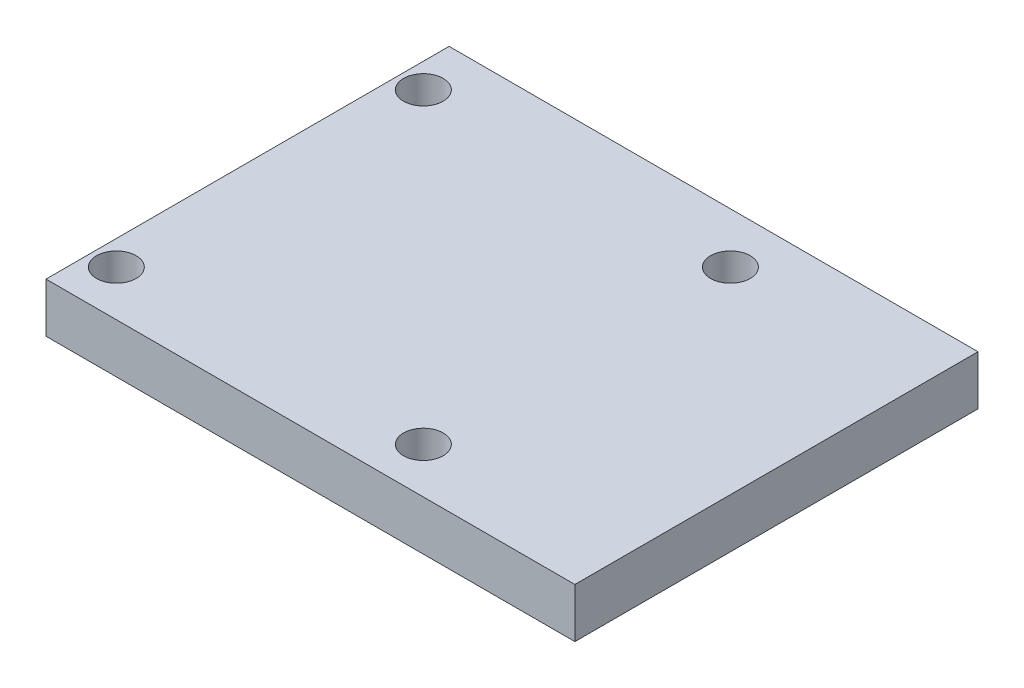
ISO-10303-21;
HEADER;
FILE_DESCRIPTION(('STEP AP214'),'2;1');
FILE_NAME('part.step','',(''),(''),'','','');
FILE_SCHEMA(('AUTOMOTIVE_DESIGN { 1 0 10303 214 1 1 1 1 }'));
ENDSEC;
DATA;
#1=APPLICATION_CONTEXT('core data for automotive mechanical design processes');
#2=APPLICATION_PROTOCOL_DEFINITION('international standard','automotive_design',2000,#1);
#3=PRODUCT_CONTEXT('',#1,'mechanical');
#4=PRODUCT('Part','Part','',(#3));
#5=PRODUCT_RELATED_PRODUCT_CATEGORY('part','',(#4));
#6=PRODUCT_DEFINITION_FORMATION('','',#4);
#7=PRODUCT_DEFINITION_CONTEXT('part definition',#1,'design');
#8=PRODUCT_DEFINITION('design','',#6,#7);
#9=PRODUCT_DEFINITION_SHAPE('','',#8);
#10=(LENGTH_UNIT() NAMED_UNIT(*) SI_UNIT(.MILLI.,.METRE.));
#11=(NAMED_UNIT(*) PLANE_ANGLE_UNIT() SI_UNIT($,.RADIAN.));
#12=(NAMED_UNIT(*) SI_UNIT($,.STERADIAN.) SOLID_ANGLE_UNIT());
#13=UNCERTAINTY_MEASURE_WITH_UNIT(LENGTH_MEASURE(1.E-05),#10,'distance_accuracy_value','');
#14=(GEOMETRIC_REPRESENTATION_CONTEXT(3) GLOBAL_UNCERTAINTY_ASSIGNED_CONTEXT((#13)) GLOBAL_UNIT_ASSIGNED_CONTEXT((#10,
#11,#12)) REPRESENTATION_CONTEXT('',''));
#15=CARTESIAN_POINT('',(0.,0.,0.));
#16=DIRECTION('',(0.,0.,1.));
#17=DIRECTION('',(1.,0.,0.));
#18=AXIS2_PLACEMENT_3D('',#15,#16,#17);
#19=CARTESIAN_POINT('',(26.7,5.,20.35));
#20=DIRECTION('',(-1.,0.,0.));
#21=DIRECTION('',(0.,0.,1.));
#22=AXIS2_PLACEMENT_3D('',#19,#20,#21);
#23=PLANE('',#22);
#24=DIRECTION('',(0.,0.,-1.));
#25=VECTOR('',#24,1.);
#26=CARTESIAN_POINT('',(26.7,0.,20.35));
#27=LINE('',#26,#25);
#28=CARTESIAN_POINT('',(26.7,0.,20.35));
#29=VERTEX_POINT('',#28);
#30=CARTESIAN_POINT('',(26.7,0.,-20.35));
#31=VERTEX_POINT('',#30);
#32=EDGE_CURVE('E106',#29,#31,#27,.T.);
#33=ORIENTED_EDGE('',*,*,#32,.T.);
#34=DIRECTION('',(0.,-1.,0.));
#35=VECTOR('',#34,1.);
#36=CARTESIAN_POINT('',(26.7,5.,-20.35));
#37=LINE('',#36,#35);
#38=CARTESIAN_POINT('',(26.7,5.,-20.35));
#39=VERTEX_POINT('',#38);
#40=EDGE_CURVE('E11',#39,#31,#37,.T.);
#41=ORIENTED_EDGE('',*,*,#40,.F.);
#42=DIRECTION('',(0.,0.,-1.));
#43=VECTOR('',#42,1.);
#44=CARTESIAN_POINT('',(26.7,5.,20.35));
#45=LINE('',#44,#43);
#46=CARTESIAN_POINT('',(26.7,5.,20.35));
#47=VERTEX_POINT('',#46);
#48=EDGE_CURVE('E94',#47,#39,#45,.T.);
#49=ORIENTED_EDGE('',*,*,#48,.F.);
#50=DIRECTION('',(0.,-1.,0.));
#51=VECTOR('',#50,1.);
#52=CARTESIAN_POINT('',(26.7,5.,20.35));
#53=LINE('',#52,#51);
#54=EDGE_CURVE('E102',#47,#29,#53,.T.);
#55=ORIENTED_EDGE('',*,*,#54,.T.);
#56=EDGE_LOOP('',(#33,#41,#49,#55));
#57=FACE_BOUND('',#56,.T.);
#58=ADVANCED_FACE('F43',(#57),#23,.F.);
#59=CARTESIAN_POINT('',(-26.7,5.,-20.35));
#60=DIRECTION('',(0.,0.,1.));
#61=DIRECTION('',(1.,0.,0.));
#62=AXIS2_PLACEMENT_3D('',#59,#60,#61);
#63=PLANE('',#62);
#64=DIRECTION('',(-1.,0.,0.));
#65=VECTOR('',#64,1.);
#66=CARTESIAN_POINT('',(-26.7,0.,-20.35));
#67=LINE('',#66,#65);
#68=CARTESIAN_POINT('',(-26.7,0.,-20.35));
#69=VERTEX_POINT('',#68);
#70=EDGE_CURVE('E98',#31,#69,#67,.T.);
#71=ORIENTED_EDGE('',*,*,#70,.T.);
#72=DIRECTION('',(0.,-1.,0.));
#73=VECTOR('',#72,1.);
#74=CARTESIAN_POINT('',(-26.7,5.,-20.35));
#75=LINE('',#74,#73);
#76=CARTESIAN_POINT('',(-26.7,5.,-20.35));
#77=VERTEX_POINT('',#76);
#78=EDGE_CURVE('E51',#77,#69,#75,.T.);
#79=ORIENTED_EDGE('',*,*,#78,.F.);
#80=DIRECTION('',(-1.,0.,0.));
#81=VECTOR('',#80,1.);
#82=CARTESIAN_POINT('',(-26.7,5.,-20.35));
#83=LINE('',#82,#81);
#84=EDGE_CURVE('E89',#39,#77,#83,.T.);
#85=ORIENTED_EDGE('',*,*,#84,.F.);
#86=ORIENTED_EDGE('',*,*,#40,.T.);
#87=EDGE_LOOP('',(#71,#79,#85,#86));
#88=FACE_BOUND('',#87,.T.);
#89=ADVANCED_FACE('F97',(#88),#63,.F.);
#90=CARTESIAN_POINT('',(-26.7,5.,20.35));
#91=DIRECTION('',(1.,0.,0.));
#92=DIRECTION('',(0.,0.,-1.));
#93=AXIS2_PLACEMENT_3D('',#90,#91,#92);
#94=PLANE('',#93);
#95=DIRECTION('',(0.,0.,1.));
#96=VECTOR('',#95,1.);
#97=CARTESIAN_POINT('',(-26.7,0.,20.35));
#98=LINE('',#97,#96);
#99=CARTESIAN_POINT('',(-26.7,0.,20.35));
#100=VERTEX_POINT('',#99);
#101=EDGE_CURVE('E76',#69,#100,#98,.T.);
#102=ORIENTED_EDGE('',*,*,#101,.T.);
#103=DIRECTION('',(0.,-1.,0.));
#104=VECTOR('',#103,1.);
#105=CARTESIAN_POINT('',(-26.7,5.,20.35));
#106=LINE('',#105,#104);
#107=CARTESIAN_POINT('',(-26.7,5.,20.35));
#108=VERTEX_POINT('',#107);
#109=EDGE_CURVE('E99',#108,#100,#106,.T.);
#110=ORIENTED_EDGE('',*,*,#109,.F.);
#111=DIRECTION('',(0.,0.,1.));
#112=VECTOR('',#111,1.);
#113=CARTESIAN_POINT('',(-26.7,5.,20.35));
#114=LINE('',#113,#112);
#115=EDGE_CURVE('E92',#77,#108,#114,.T.);
#116=ORIENTED_EDGE('',*,*,#115,.F.);
#117=ORIENTED_EDGE('',*,*,#78,.T.);
#118=EDGE_LOOP('',(#102,#110,#116,#117));
#119=FACE_BOUND('',#118,.T.);
#120=ADVANCED_FACE('F100',(#119),#94,.F.);
#121=CARTESIAN_POINT('',(-26.7,5.,20.35));
#122=DIRECTION('',(0.,0.,-1.));
#123=DIRECTION('',(-1.,0.,0.));
#124=AXIS2_PLACEMENT_3D('',#121,#122,#123);
#125=PLANE('',#124);
#126=DIRECTION('',(1.,0.,0.));
#127=VECTOR('',#126,1.);
#128=CARTESIAN_POINT('',(-26.7,0.,20.35));
#129=LINE('',#128,#127);
#130=EDGE_CURVE('E82',#100,#29,#129,.T.);
#131=ORIENTED_EDGE('',*,*,#130,.T.);
#132=ORIENTED_EDGE('',*,*,#54,.F.);
#133=DIRECTION('',(1.,0.,0.));
#134=VECTOR('',#133,1.);
#135=CARTESIAN_POINT('',(-26.7,5.,20.35));
#136=LINE('',#135,#134);
#137=EDGE_CURVE('E59',#108,#47,#136,.T.);
#138=ORIENTED_EDGE('',*,*,#137,.F.);
#139=ORIENTED_EDGE('',*,*,#109,.T.);
#140=EDGE_LOOP('',(#131,#132,#138,#139));
#141=FACE_BOUND('',#140,.T.);
#142=ADVANCED_FACE('F114',(#141),#125,.F.);
#143=CARTESIAN_POINT('',(0.,5.,0.));
#144=DIRECTION('',(0.,-1.,0.));
#145=DIRECTION('',(0.,0.,-1.));
#146=AXIS2_PLACEMENT_3D('',#143,#144,#145);
#147=PLANE('',#146);
#148=CARTESIAN_POINT('',(-24.2,5.,15.75));
#149=DIRECTION('',(0.,1.,0.));
#150=DIRECTION('',(0.,0.,1.));
#151=AXIS2_PLACEMENT_3D('',#148,#149,#150);
#152=CIRCLE('',#151,2.);
#153=CARTESIAN_POINT('',(-24.2,5.,17.75));
#154=VERTEX_POINT('',#153);
#155=EDGE_CURVE('E123',#154,#154,#152,.T.);
#156=ORIENTED_EDGE('',*,*,#155,.F.);
#157=EDGE_LOOP('',(#156));
#158=FACE_BOUND('',#157,.T.);
#159=CARTESIAN_POINT('',(6.79999999999999,5.,-15.25));
#160=DIRECTION('',(0.,1.,0.));
#161=DIRECTION('',(0.,0.,1.));
#162=AXIS2_PLACEMENT_3D('',#159,#160,#161);
#163=CIRCLE('',#162,2.);
#164=CARTESIAN_POINT('',(6.79999999999999,5.,-13.25));
#165=VERTEX_POINT('',#164);
#166=EDGE_CURVE('E129',#165,#165,#163,.T.);
#167=ORIENTED_EDGE('',*,*,#166,.F.);
#168=EDGE_LOOP('',(#167));
#169=FACE_BOUND('',#168,.T.);
#170=CARTESIAN_POINT('',(6.79999999999999,5.,15.75));
#171=DIRECTION('',(0.,1.,0.));
#172=DIRECTION('',(0.,0.,1.));
#173=AXIS2_PLACEMENT_3D('',#170,#171,#172);
#174=CIRCLE('',#173,2.);
#175=CARTESIAN_POINT('',(6.79999999999999,5.,17.75));
#176=VERTEX_POINT('',#175);
#177=EDGE_CURVE('E130',#176,#176,#174,.T.);
#178=ORIENTED_EDGE('',*,*,#177,.F.);
#179=EDGE_LOOP('',(#178));
#180=FACE_BOUND('',#179,.T.);
#181=CARTESIAN_POINT('',(-24.2,5.,-15.25));
#182=DIRECTION('',(0.,1.,0.));
#183=DIRECTION('',(0.,0.,1.));
#184=AXIS2_PLACEMENT_3D('',#181,#182,#183);
#185=CIRCLE('',#184,2.);
#186=CARTESIAN_POINT('',(-24.2,5.,-13.25));
#187=VERTEX_POINT('',#186);
#188=EDGE_CURVE('E120',#187,#187,#185,.T.);
#189=ORIENTED_EDGE('',*,*,#188,.F.);
#190=EDGE_LOOP('',(#189));
#191=FACE_BOUND('',#190,.T.);
#192=ORIENTED_EDGE('',*,*,#48,.T.);
#193=ORIENTED_EDGE('',*,*,#84,.T.);
#194=ORIENTED_EDGE('',*,*,#115,.T.);
#195=ORIENTED_EDGE('',*,*,#137,.T.);
#196=EDGE_LOOP('',(#192,#193,#194,#195));
#197=FACE_BOUND('',#196,.T.);
#198=ADVANCED_FACE('F90',(#158,#169,#180,#191,#197),#147,.F.);
#199=CARTESIAN_POINT('',(0.,0.,0.));
#200=DIRECTION('',(0.,-1.,0.));
#201=DIRECTION('',(0.,0.,-1.));
#202=AXIS2_PLACEMENT_3D('',#199,#200,#201);
#203=PLANE('',#202);
#204=CARTESIAN_POINT('',(-24.2,0.,15.75));
#205=DIRECTION('',(0.,1.,0.));
#206=DIRECTION('',(0.,0.,1.));
#207=AXIS2_PLACEMENT_3D('',#204,#205,#206);
#208=CIRCLE('',#207,2.);
#209=CARTESIAN_POINT('',(-24.2,0.,17.75));
#210=VERTEX_POINT('',#209);
#211=EDGE_CURVE('E133',#210,#210,#208,.T.);
#212=ORIENTED_EDGE('',*,*,#211,.T.);
#213=EDGE_LOOP('',(#212));
#214=FACE_BOUND('',#213,.T.);
#215=CARTESIAN_POINT('',(6.79999999999999,0.,-15.25));
#216=DIRECTION('',(0.,1.,0.));
#217=DIRECTION('',(0.,0.,1.));
#218=AXIS2_PLACEMENT_3D('',#215,#216,#217);
#219=CIRCLE('',#218,2.);
#220=CARTESIAN_POINT('',(6.79999999999999,0.,-13.25));
#221=VERTEX_POINT('',#220);
#222=EDGE_CURVE('E126',#221,#221,#219,.T.);
#223=ORIENTED_EDGE('',*,*,#222,.T.);
#224=EDGE_LOOP('',(#223));
#225=FACE_BOUND('',#224,.T.);
#226=CARTESIAN_POINT('',(6.79999999999999,0.,15.75));
#227=DIRECTION('',(0.,1.,0.));
#228=DIRECTION('',(0.,0.,1.));
#229=AXIS2_PLACEMENT_3D('',#226,#227,#228);
#230=CIRCLE('',#229,2.);
#231=CARTESIAN_POINT('',(6.79999999999999,0.,17.75));
#232=VERTEX_POINT('',#231);
#233=EDGE_CURVE('E138',#232,#232,#230,.T.);
#234=ORIENTED_EDGE('',*,*,#233,.T.);
#235=EDGE_LOOP('',(#234));
#236=FACE_BOUND('',#235,.T.);
#237=CARTESIAN_POINT('',(-24.2,0.,-15.25));
#238=DIRECTION('',(0.,1.,0.));
#239=DIRECTION('',(0.,0.,1.));
#240=AXIS2_PLACEMENT_3D('',#237,#238,#239);
#241=CIRCLE('',#240,2.);
#242=CARTESIAN_POINT('',(-24.2,0.,-13.25));
#243=VERTEX_POINT('',#242);
#244=EDGE_CURVE('E109',#243,#243,#241,.T.);
#245=ORIENTED_EDGE('',*,*,#244,.T.);
#246=EDGE_LOOP('',(#245));
#247=FACE_BOUND('',#246,.T.);
#248=ORIENTED_EDGE('',*,*,#32,.F.);
#249=ORIENTED_EDGE('',*,*,#130,.F.);
#250=ORIENTED_EDGE('',*,*,#101,.F.);
#251=ORIENTED_EDGE('',*,*,#70,.F.);
#252=EDGE_LOOP('',(#248,#249,#250,#251));
#253=FACE_BOUND('',#252,.T.);
#254=ADVANCED_FACE('F117',(#214,#225,#236,#247,#253),#203,.T.);
#255=CARTESIAN_POINT('',(-24.2,0.,-15.25));
#256=DIRECTION('',(0.,1.,0.));
#257=DIRECTION('',(0.,0.,1.));
#258=AXIS2_PLACEMENT_3D('',#255,#256,#257);
#259=CYLINDRICAL_SURFACE('',#258,2.);
#260=ORIENTED_EDGE('',*,*,#244,.F.);
#261=EDGE_LOOP('',(#260));
#262=FACE_BOUND('',#261,.T.);
#263=ORIENTED_EDGE('',*,*,#188,.T.);
#264=EDGE_LOOP('',(#263));
#265=FACE_BOUND('',#264,.T.);
#266=ADVANCED_FACE('F152',(#262,#265),#259,.F.);
#267=CARTESIAN_POINT('',(6.79999999999999,0.,15.75));
#268=DIRECTION('',(0.,1.,0.));
#269=DIRECTION('',(0.,0.,1.));
#270=AXIS2_PLACEMENT_3D('',#267,#268,#269);
#271=CYLINDRICAL_SURFACE('',#270,2.);
#272=ORIENTED_EDGE('',*,*,#233,.F.);
#273=EDGE_LOOP('',(#272));
#274=FACE_BOUND('',#273,.T.);
#275=ORIENTED_EDGE('',*,*,#177,.T.);
#276=EDGE_LOOP('',(#275));
#277=FACE_BOUND('',#276,.T.);
#278=ADVANCED_FACE('F144',(#274,#277),#271,.F.);
#279=CARTESIAN_POINT('',(6.79999999999999,0.,-15.25));
#280=DIRECTION('',(0.,1.,0.));
#281=DIRECTION('',(0.,0.,1.));
#282=AXIS2_PLACEMENT_3D('',#279,#280,#281);
#283=CYLINDRICAL_SURFACE('',#282,2.);
#284=ORIENTED_EDGE('',*,*,#222,.F.);
#285=EDGE_LOOP('',(#284));
#286=FACE_BOUND('',#285,.T.);
#287=ORIENTED_EDGE('',*,*,#166,.T.);
#288=EDGE_LOOP('',(#287));
#289=FACE_BOUND('',#288,.T.);
#290=ADVANCED_FACE('F160',(#286,#289),#283,.F.);
#291=CARTESIAN_POINT('',(-24.2,0.,15.75));
#292=DIRECTION('',(0.,1.,0.));
#293=DIRECTION('',(0.,0.,1.));
#294=AXIS2_PLACEMENT_3D('',#291,#292,#293);
#295=CYLINDRICAL_SURFACE('',#294,2.);
#296=ORIENTED_EDGE('',*,*,#211,.F.);
#297=EDGE_LOOP('',(#296));
#298=FACE_BOUND('',#297,.T.);
#299=ORIENTED_EDGE('',*,*,#155,.T.);
#300=EDGE_LOOP('',(#299));
#301=FACE_BOUND('',#300,.T.);
#302=ADVANCED_FACE('F211',(#298,#301),#295,.F.);
#303=CLOSED_SHELL('',(#58,#89,#120,#142,#198,#254,#266,#278,#290,#302));
#304=MANIFOLD_SOLID_BREP('B2',#303);
#305=ADVANCED_BREP_SHAPE_REPRESENTATION('',(#18,#304),#14);
#306=SHAPE_DEFINITION_REPRESENTATION(#9,#305);
ENDSEC;
END-ISO-10303-21;
